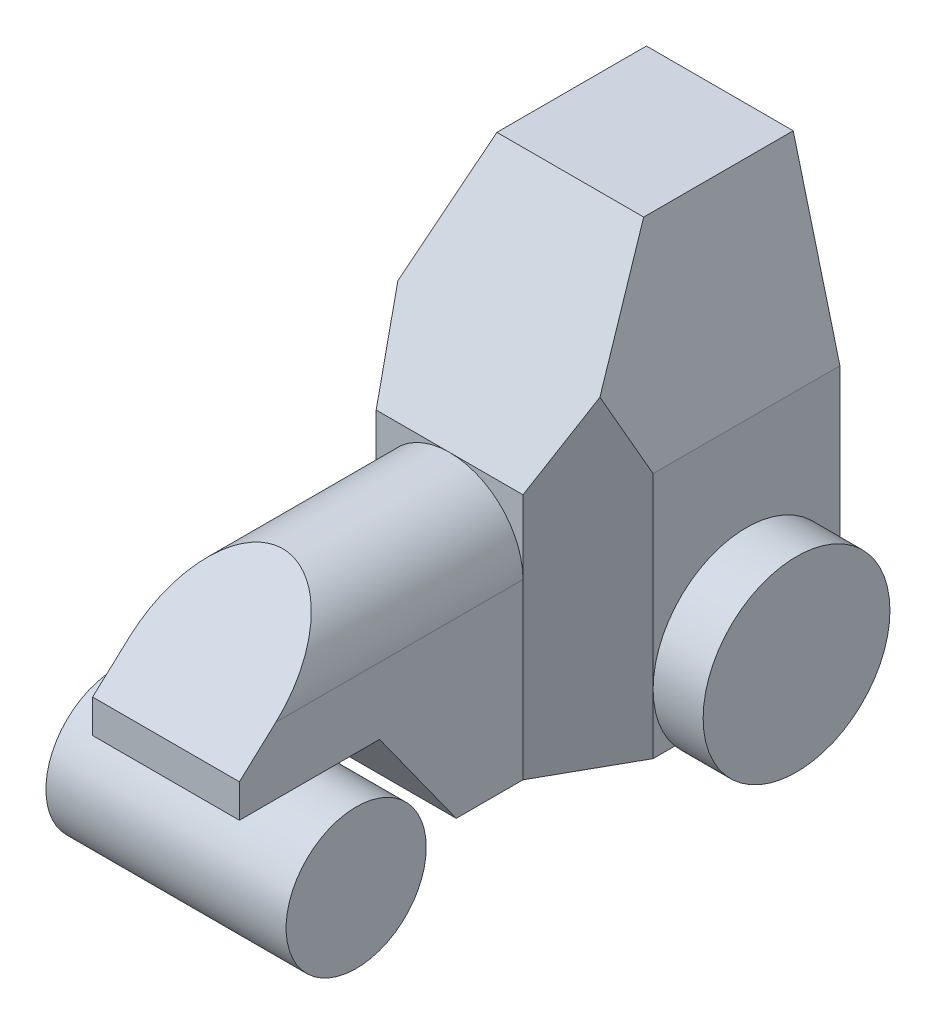
ISO-10303-21;
HEADER;
FILE_DESCRIPTION(('STEP AP214'),'2;1');
FILE_NAME('part.step','',(''),(''),'','','');
FILE_SCHEMA(('AUTOMOTIVE_DESIGN { 1 0 10303 214 1 1 1 1 }'));
ENDSEC;
DATA;
#1=APPLICATION_CONTEXT('core data for automotive mechanical design processes');
#2=APPLICATION_PROTOCOL_DEFINITION('international standard','automotive_design',2000,#1);
#3=PRODUCT_CONTEXT('',#1,'mechanical');
#4=PRODUCT('Part','Part','',(#3));
#5=PRODUCT_RELATED_PRODUCT_CATEGORY('part','',(#4));
#6=PRODUCT_DEFINITION_FORMATION('','',#4);
#7=PRODUCT_DEFINITION_CONTEXT('part definition',#1,'design');
#8=PRODUCT_DEFINITION('design','',#6,#7);
#9=PRODUCT_DEFINITION_SHAPE('','',#8);
#10=(LENGTH_UNIT() NAMED_UNIT(*) SI_UNIT(.MILLI.,.METRE.));
#11=(NAMED_UNIT(*) PLANE_ANGLE_UNIT() SI_UNIT($,.RADIAN.));
#12=(NAMED_UNIT(*) SI_UNIT($,.STERADIAN.) SOLID_ANGLE_UNIT());
#13=UNCERTAINTY_MEASURE_WITH_UNIT(LENGTH_MEASURE(1.E-05),#10,'distance_accuracy_value','');
#14=(GEOMETRIC_REPRESENTATION_CONTEXT(3) GLOBAL_UNCERTAINTY_ASSIGNED_CONTEXT((#13)) GLOBAL_UNIT_ASSIGNED_CONTEXT((#10,
#11,#12)) REPRESENTATION_CONTEXT('',''));
#15=CARTESIAN_POINT('',(0.,0.,0.));
#16=DIRECTION('',(0.,0.,1.));
#17=DIRECTION('',(1.,0.,0.));
#18=AXIS2_PLACEMENT_3D('',#15,#16,#17);
#19=CARTESIAN_POINT('',(0.,11.,64.));
#20=DIRECTION('',(1.,0.,0.));
#21=DIRECTION('',(0.,0.,-1.));
#22=AXIS2_PLACEMENT_3D('',#19,#20,#21);
#23=CYLINDRICAL_SURFACE('',#22,21.);
#24=CARTESIAN_POINT('',(0.,11.,64.));
#25=DIRECTION('',(1.,0.,0.));
#26=DIRECTION('',(0.,0.,-1.));
#27=AXIS2_PLACEMENT_3D('',#24,#25,#26);
#28=CIRCLE('',#27,21.);
#29=CARTESIAN_POINT('',(0.,11.,43.));
#30=VERTEX_POINT('',#29);
#31=EDGE_CURVE('E11',#30,#30,#28,.T.);
#32=ORIENTED_EDGE('',*,*,#31,.T.);
#33=EDGE_LOOP('',(#32));
#34=FACE_BOUND('',#33,.T.);
#35=CARTESIAN_POINT('',(72.,11.,64.));
#36=DIRECTION('',(1.,0.,0.));
#37=DIRECTION('',(0.,0.,-1.));
#38=AXIS2_PLACEMENT_3D('',#35,#36,#37);
#39=CIRCLE('',#38,21.);
#40=CARTESIAN_POINT('',(72.,11.,43.));
#41=VERTEX_POINT('',#40);
#42=EDGE_CURVE('E52',#41,#41,#39,.T.);
#43=ORIENTED_EDGE('',*,*,#42,.F.);
#44=EDGE_LOOP('',(#43));
#45=FACE_BOUND('',#44,.T.);
#46=ADVANCED_FACE('F49',(#34,#45),#23,.T.);
#47=CARTESIAN_POINT('',(0.,11.,64.));
#48=DIRECTION('',(1.,0.,0.));
#49=DIRECTION('',(0.,0.,-1.));
#50=AXIS2_PLACEMENT_3D('',#47,#48,#49);
#51=PLANE('',#50);
#52=ORIENTED_EDGE('',*,*,#31,.F.);
#53=EDGE_LOOP('',(#52));
#54=FACE_BOUND('',#53,.T.);
#55=ADVANCED_FACE('F64',(#54),#51,.F.);
#56=CARTESIAN_POINT('',(72.,11.,64.));
#57=DIRECTION('',(1.,0.,0.));
#58=DIRECTION('',(0.,0.,-1.));
#59=AXIS2_PLACEMENT_3D('',#56,#57,#58);
#60=PLANE('',#59);
#61=ORIENTED_EDGE('',*,*,#42,.T.);
#62=EDGE_LOOP('',(#61));
#63=FACE_BOUND('',#62,.T.);
#64=ADVANCED_FACE('F61',(#63),#60,.T.);
#65=CLOSED_SHELL('',(#46,#55,#64));
#66=MANIFOLD_SOLID_BREP('B2',#65);
#67=CARTESIAN_POINT('',(0.,128.,0.));
#68=DIRECTION('',(0.,0.,-1.));
#69=DIRECTION('',(-1.,0.,0.));
#70=AXIS2_PLACEMENT_3D('',#67,#68,#69);
#71=PLANE('',#70);
#72=CARTESIAN_POINT('',(36.,52.,0.));
#73=DIRECTION('',(0.,0.,1.));
#74=DIRECTION('',(1.,0.,0.));
#75=AXIS2_PLACEMENT_3D('',#72,#73,#74);
#76=CIRCLE('',#75,22.);
#77=CARTESIAN_POINT('',(58.,52.,0.));
#78=VERTEX_POINT('',#77);
#79=CARTESIAN_POINT('',(36.,74.,0.));
#80=VERTEX_POINT('',#79);
#81=EDGE_CURVE('E262',#78,#80,#76,.T.);
#82=ORIENTED_EDGE('',*,*,#81,.F.);
#83=DIRECTION('',(0.,1.,0.));
#84=VECTOR('',#83,1.);
#85=CARTESIAN_POINT('',(58.,0.,0.));
#86=LINE('',#85,#84);
#87=CARTESIAN_POINT('',(58.,74.,0.));
#88=VERTEX_POINT('',#87);
#89=EDGE_CURVE('E343',#78,#88,#86,.T.);
#90=ORIENTED_EDGE('',*,*,#89,.T.);
#91=DIRECTION('',(1.,0.,0.));
#92=VECTOR('',#91,1.);
#93=CARTESIAN_POINT('',(-56.,74.,0.));
#94=LINE('',#93,#92);
#95=EDGE_CURVE('E284',#80,#88,#94,.T.);
#96=ORIENTED_EDGE('',*,*,#95,.F.);
#97=EDGE_LOOP('',(#82,#90,#96));
#98=FACE_BOUND('',#97,.T.);
#99=ADVANCED_FACE('F90',(#98),#71,.F.);
#100=CARTESIAN_POINT('',(0.,128.,0.));
#101=DIRECTION('',(1.,0.,0.));
#102=DIRECTION('',(0.,0.,-1.));
#103=AXIS2_PLACEMENT_3D('',#100,#101,#102);
#104=PLANE('',#103);
#105=CARTESIAN_POINT('',(0.,18.,-53.));
#106=DIRECTION('',(-1.,0.,0.));
#107=DIRECTION('',(0.,0.,1.));
#108=AXIS2_PLACEMENT_3D('',#105,#106,#107);
#109=CIRCLE('',#108,28.);
#110=CARTESIAN_POINT('',(0.,18.,-81.));
#111=VERTEX_POINT('',#110);
#112=CARTESIAN_POINT('',(0.,0.,-74.4476105895272));
#113=VERTEX_POINT('',#112);
#114=EDGE_CURVE('E456',#111,#113,#109,.T.);
#115=ORIENTED_EDGE('',*,*,#114,.F.);
#116=DIRECTION('',(0.,-1.,0.));
#117=VECTOR('',#116,1.);
#118=CARTESIAN_POINT('',(0.,128.,-81.));
#119=LINE('',#118,#117);
#120=CARTESIAN_POINT('',(0.,0.,-81.));
#121=VERTEX_POINT('',#120);
#122=EDGE_CURVE('E363',#111,#121,#119,.T.);
#123=ORIENTED_EDGE('',*,*,#122,.T.);
#124=DIRECTION('',(0.,0.,1.));
#125=VECTOR('',#124,1.);
#126=CARTESIAN_POINT('',(0.,0.,0.));
#127=LINE('',#126,#125);
#128=EDGE_CURVE('E365',#121,#113,#127,.T.);
#129=ORIENTED_EDGE('',*,*,#128,.T.);
#130=EDGE_LOOP('',(#115,#123,#129));
#131=FACE_BOUND('',#130,.T.);
#132=ADVANCED_FACE('F525',(#131),#104,.F.);
#133=CARTESIAN_POINT('',(0.,18.,-25.));
#134=VERTEX_POINT('',#133);
#135=EDGE_CURVE('E275',#134,#111,#109,.T.);
#136=ORIENTED_EDGE('',*,*,#135,.F.);
#137=DIRECTION('',(0.,1.,0.));
#138=VECTOR('',#137,1.);
#139=CARTESIAN_POINT('',(0.,0.,-25.));
#140=LINE('',#139,#138);
#141=CARTESIAN_POINT('',(0.,74.,-25.));
#142=VERTEX_POINT('',#141);
#143=EDGE_CURVE('E351',#134,#142,#140,.T.);
#144=ORIENTED_EDGE('',*,*,#143,.T.);
#145=DIRECTION('',(0.,0.,1.));
#146=VECTOR('',#145,1.);
#147=CARTESIAN_POINT('',(0.,74.,-81.));
#148=LINE('',#147,#146);
#149=CARTESIAN_POINT('',(0.,74.,-81.));
#150=VERTEX_POINT('',#149);
#151=EDGE_CURVE('E328',#150,#142,#148,.T.);
#152=ORIENTED_EDGE('',*,*,#151,.F.);
#153=EDGE_CURVE('E379',#150,#111,#119,.T.);
#154=ORIENTED_EDGE('',*,*,#153,.T.);
#155=EDGE_LOOP('',(#136,#144,#152,#154));
#156=FACE_BOUND('',#155,.T.);
#157=ADVANCED_FACE('F519',(#156),#104,.F.);
#158=CARTESIAN_POINT('',(72.,128.,0.));
#159=DIRECTION('',(-1.,0.,0.));
#160=DIRECTION('',(0.,0.,1.));
#161=AXIS2_PLACEMENT_3D('',#158,#159,#160);
#162=PLANE('',#161);
#163=CARTESIAN_POINT('',(72.,18.,-53.));
#164=DIRECTION('',(1.,0.,0.));
#165=DIRECTION('',(0.,0.,-1.));
#166=AXIS2_PLACEMENT_3D('',#163,#164,#165);
#167=CIRCLE('',#166,28.);
#168=CARTESIAN_POINT('',(72.,18.,-25.));
#169=VERTEX_POINT('',#168);
#170=CARTESIAN_POINT('',(72.,0.,-31.5523894104728));
#171=VERTEX_POINT('',#170);
#172=EDGE_CURVE('E453',#169,#171,#167,.T.);
#173=ORIENTED_EDGE('',*,*,#172,.F.);
#174=DIRECTION('',(0.,1.,0.));
#175=VECTOR('',#174,1.);
#176=CARTESIAN_POINT('',(72.,0.,-25.));
#177=LINE('',#176,#175);
#178=CARTESIAN_POINT('',(72.,0.,-25.));
#179=VERTEX_POINT('',#178);
#180=EDGE_CURVE('E344',#179,#169,#177,.T.);
#181=ORIENTED_EDGE('',*,*,#180,.F.);
#182=DIRECTION('',(0.,0.,-1.));
#183=VECTOR('',#182,1.);
#184=CARTESIAN_POINT('',(72.,0.,0.));
#185=LINE('',#184,#183);
#186=EDGE_CURVE('E371',#179,#171,#185,.T.);
#187=ORIENTED_EDGE('',*,*,#186,.T.);
#188=EDGE_LOOP('',(#173,#181,#187));
#189=FACE_BOUND('',#188,.T.);
#190=ADVANCED_FACE('F517',(#189),#162,.F.);
#191=CARTESIAN_POINT('',(72.,18.,-81.));
#192=VERTEX_POINT('',#191);
#193=EDGE_CURVE('E285',#192,#169,#167,.T.);
#194=ORIENTED_EDGE('',*,*,#193,.F.);
#195=DIRECTION('',(0.,-1.,0.));
#196=VECTOR('',#195,1.);
#197=CARTESIAN_POINT('',(72.,128.,-81.));
#198=LINE('',#197,#196);
#199=CARTESIAN_POINT('',(72.,74.,-81.));
#200=VERTEX_POINT('',#199);
#201=EDGE_CURVE('E384',#200,#192,#198,.T.);
#202=ORIENTED_EDGE('',*,*,#201,.F.);
#203=DIRECTION('',(0.,0.,1.));
#204=VECTOR('',#203,1.);
#205=CARTESIAN_POINT('',(72.,74.,-81.));
#206=LINE('',#205,#204);
#207=CARTESIAN_POINT('',(72.,74.,-25.));
#208=VERTEX_POINT('',#207);
#209=EDGE_CURVE('E317',#200,#208,#206,.T.);
#210=ORIENTED_EDGE('',*,*,#209,.T.);
#211=EDGE_CURVE('E337',#169,#208,#177,.T.);
#212=ORIENTED_EDGE('',*,*,#211,.F.);
#213=EDGE_LOOP('',(#194,#202,#210,#212));
#214=FACE_BOUND('',#213,.T.);
#215=ADVANCED_FACE('F499',(#214),#162,.F.);
#216=CARTESIAN_POINT('',(0.,0.,-31.5523894104728));
#217=VERTEX_POINT('',#216);
#218=EDGE_CURVE('E279',#217,#134,#109,.T.);
#219=ORIENTED_EDGE('',*,*,#218,.F.);
#220=CARTESIAN_POINT('',(0.,0.,-25.));
#221=VERTEX_POINT('',#220);
#222=EDGE_CURVE('E342',#217,#221,#127,.T.);
#223=ORIENTED_EDGE('',*,*,#222,.T.);
#224=EDGE_CURVE('E356',#221,#134,#140,.T.);
#225=ORIENTED_EDGE('',*,*,#224,.T.);
#226=EDGE_LOOP('',(#219,#223,#225));
#227=FACE_BOUND('',#226,.T.);
#228=ADVANCED_FACE('F92',(#227),#104,.F.);
#229=CARTESIAN_POINT('',(14.,52.,0.));
#230=VERTEX_POINT('',#229);
#231=EDGE_CURVE('E401',#80,#230,#76,.T.);
#232=ORIENTED_EDGE('',*,*,#231,.F.);
#233=CARTESIAN_POINT('',(14.,74.,0.));
#234=VERTEX_POINT('',#233);
#235=EDGE_CURVE('E295',#234,#80,#94,.T.);
#236=ORIENTED_EDGE('',*,*,#235,.F.);
#237=DIRECTION('',(0.,1.,0.));
#238=VECTOR('',#237,1.);
#239=CARTESIAN_POINT('',(14.,0.,0.));
#240=LINE('',#239,#238);
#241=EDGE_CURVE('E355',#230,#234,#240,.T.);
#242=ORIENTED_EDGE('',*,*,#241,.F.);
#243=EDGE_LOOP('',(#232,#236,#242));
#244=FACE_BOUND('',#243,.T.);
#245=ADVANCED_FACE('F446',(#244),#71,.F.);
#246=CARTESIAN_POINT('',(72.,0.,-74.4476105895272));
#247=VERTEX_POINT('',#246);
#248=EDGE_CURVE('E289',#247,#192,#167,.T.);
#249=ORIENTED_EDGE('',*,*,#248,.F.);
#250=CARTESIAN_POINT('',(72.,0.,-81.));
#251=VERTEX_POINT('',#250);
#252=EDGE_CURVE('E369',#247,#251,#185,.T.);
#253=ORIENTED_EDGE('',*,*,#252,.T.);
#254=EDGE_CURVE('E383',#192,#251,#198,.T.);
#255=ORIENTED_EDGE('',*,*,#254,.F.);
#256=EDGE_LOOP('',(#249,#253,#255));
#257=FACE_BOUND('',#256,.T.);
#258=ADVANCED_FACE('F475',(#257),#162,.F.);
#259=CARTESIAN_POINT('',(0.,128.,-81.));
#260=DIRECTION('',(0.,0.,1.));
#261=DIRECTION('',(1.,0.,0.));
#262=AXIS2_PLACEMENT_3D('',#259,#260,#261);
#263=PLANE('',#262);
#264=DIRECTION('',(-1.,0.,0.));
#265=VECTOR('',#264,1.);
#266=CARTESIAN_POINT('',(0.,128.,-81.));
#267=LINE('',#266,#265);
#268=CARTESIAN_POINT('',(58.,128.,-81.));
#269=VERTEX_POINT('',#268);
#270=CARTESIAN_POINT('',(14.,128.,-81.));
#271=VERTEX_POINT('',#270);
#272=EDGE_CURVE('E359',#269,#271,#267,.T.);
#273=ORIENTED_EDGE('',*,*,#272,.F.);
#274=DIRECTION('',(0.250962158783726,-0.967996898165801,0.));
#275=VECTOR('',#274,1.);
#276=CARTESIAN_POINT('',(58.,128.,-81.));
#277=LINE('',#276,#275);
#278=EDGE_CURVE('E311',#269,#200,#277,.T.);
#279=ORIENTED_EDGE('',*,*,#278,.T.);
#280=ORIENTED_EDGE('',*,*,#201,.T.);
#281=ORIENTED_EDGE('',*,*,#254,.T.);
#282=DIRECTION('',(-1.,0.,0.));
#283=VECTOR('',#282,1.);
#284=CARTESIAN_POINT('',(0.,0.,-81.));
#285=LINE('',#284,#283);
#286=EDGE_CURVE('E364',#251,#121,#285,.T.);
#287=ORIENTED_EDGE('',*,*,#286,.T.);
#288=ORIENTED_EDGE('',*,*,#122,.F.);
#289=ORIENTED_EDGE('',*,*,#153,.F.);
#290=DIRECTION('',(0.250962158783726,0.967996898165801,0.));
#291=VECTOR('',#290,1.);
#292=CARTESIAN_POINT('',(14.,128.,-81.));
#293=LINE('',#292,#291);
#294=EDGE_CURVE('E310',#150,#271,#293,.T.);
#295=ORIENTED_EDGE('',*,*,#294,.T.);
#296=EDGE_LOOP('',(#273,#279,#280,#281,#287,#288,#289,#295));
#297=FACE_BOUND('',#296,.T.);
#298=ADVANCED_FACE('F502',(#297),#263,.F.);
#299=CARTESIAN_POINT('',(0.,128.,0.));
#300=DIRECTION('',(0.,-1.,0.));
#301=DIRECTION('',(0.,0.,-1.));
#302=AXIS2_PLACEMENT_3D('',#299,#300,#301);
#303=PLANE('',#302);
#304=DIRECTION('',(0.,0.,1.));
#305=VECTOR('',#304,1.);
#306=CARTESIAN_POINT('',(14.,128.,-81.));
#307=LINE('',#306,#305);
#308=CARTESIAN_POINT('',(14.,128.,-36.1801050302511));
#309=VERTEX_POINT('',#308);
#310=EDGE_CURVE('E316',#271,#309,#307,.T.);
#311=ORIENTED_EDGE('',*,*,#310,.T.);
#312=DIRECTION('',(1.,0.,0.));
#313=VECTOR('',#312,1.);
#314=CARTESIAN_POINT('',(-56.,128.,-36.1801050302511));
#315=LINE('',#314,#313);
#316=CARTESIAN_POINT('',(58.,128.,-36.1801050302511));
#317=VERTEX_POINT('',#316);
#318=EDGE_CURVE('E290',#309,#317,#315,.T.);
#319=ORIENTED_EDGE('',*,*,#318,.T.);
#320=DIRECTION('',(0.,0.,1.));
#321=VECTOR('',#320,1.);
#322=CARTESIAN_POINT('',(58.,128.,-81.));
#323=LINE('',#322,#321);
#324=EDGE_CURVE('E315',#269,#317,#323,.T.);
#325=ORIENTED_EDGE('',*,*,#324,.F.);
#326=ORIENTED_EDGE('',*,*,#272,.T.);
#327=EDGE_LOOP('',(#311,#319,#325,#326));
#328=FACE_BOUND('',#327,.T.);
#329=ADVANCED_FACE('F505',(#328),#303,.F.);
#330=CARTESIAN_POINT('',(0.,0.,0.));
#331=DIRECTION('',(0.,-1.,0.));
#332=DIRECTION('',(0.,0.,-1.));
#333=AXIS2_PLACEMENT_3D('',#330,#331,#332);
#334=PLANE('',#333);
#335=DIRECTION('',(1.,0.,0.));
#336=VECTOR('',#335,1.);
#337=CARTESIAN_POINT('',(-27.,0.,20.));
#338=LINE('',#337,#336);
#339=CARTESIAN_POINT('',(14.,0.,20.));
#340=VERTEX_POINT('',#339);
#341=CARTESIAN_POINT('',(58.,0.,20.));
#342=VERTEX_POINT('',#341);
#343=EDGE_CURVE('E226',#340,#342,#338,.T.);
#344=ORIENTED_EDGE('',*,*,#343,.F.);
#345=DIRECTION('',(0.,0.,-1.));
#346=VECTOR('',#345,1.);
#347=CARTESIAN_POINT('',(14.,0.,85.));
#348=LINE('',#347,#346);
#349=CARTESIAN_POINT('',(14.,0.,0.));
#350=VERTEX_POINT('',#349);
#351=EDGE_CURVE('E251',#340,#350,#348,.T.);
#352=ORIENTED_EDGE('',*,*,#351,.T.);
#353=DIRECTION('',(-0.488603368931843,0.,-0.87250601594972));
#354=VECTOR('',#353,1.);
#355=CARTESIAN_POINT('',(0.,0.,-25.));
#356=LINE('',#355,#354);
#357=EDGE_CURVE('E321',#350,#221,#356,.T.);
#358=ORIENTED_EDGE('',*,*,#357,.T.);
#359=ORIENTED_EDGE('',*,*,#222,.F.);
#360=EDGE_CURVE('E370',#113,#217,#127,.T.);
#361=ORIENTED_EDGE('',*,*,#360,.F.);
#362=ORIENTED_EDGE('',*,*,#128,.F.);
#363=ORIENTED_EDGE('',*,*,#286,.F.);
#364=ORIENTED_EDGE('',*,*,#252,.F.);
#365=EDGE_CURVE('E375',#171,#247,#185,.T.);
#366=ORIENTED_EDGE('',*,*,#365,.F.);
#367=ORIENTED_EDGE('',*,*,#186,.F.);
#368=DIRECTION('',(-0.488603368931843,0.,0.87250601594972));
#369=VECTOR('',#368,1.);
#370=CARTESIAN_POINT('',(72.,0.,-25.));
#371=LINE('',#370,#369);
#372=CARTESIAN_POINT('',(58.,0.,0.));
#373=VERTEX_POINT('',#372);
#374=EDGE_CURVE('E249',#179,#373,#371,.T.);
#375=ORIENTED_EDGE('',*,*,#374,.T.);
#376=DIRECTION('',(0.,0.,-1.));
#377=VECTOR('',#376,1.);
#378=CARTESIAN_POINT('',(58.,0.,85.));
#379=LINE('',#378,#377);
#380=EDGE_CURVE('E241',#342,#373,#379,.T.);
#381=ORIENTED_EDGE('',*,*,#380,.F.);
#382=EDGE_LOOP('',(#344,#352,#358,#359,#361,#362,#363,#364,#366,#367,#375,#381));
#383=FACE_BOUND('',#382,.T.);
#384=ADVANCED_FACE('F247',(#383),#334,.T.);
#385=CARTESIAN_POINT('',(0.,0.,-25.));
#386=DIRECTION('',(0.87250601594972,0.,-0.488603368931843));
#387=DIRECTION('',(-0.488603368931843,0.,-0.87250601594972));
#388=AXIS2_PLACEMENT_3D('',#385,#386,#387);
#389=PLANE('',#388);
#390=EDGE_CURVE('E338',#350,#230,#240,.T.);
#391=ORIENTED_EDGE('',*,*,#390,.T.);
#392=ORIENTED_EDGE('',*,*,#241,.T.);
#393=DIRECTION('',(-0.297583909598807,0.793131784961625,-0.531399838569298));
#394=VECTOR('',#393,1.);
#395=CARTESIAN_POINT('',(26.2725334437309,41.2907840704486,21.9152382923765));
#396=LINE('',#395,#394);
#397=CARTESIAN_POINT('',(5.72081397746765,96.0659967702324,-14.784260754522));
#398=VERTEX_POINT('',#397);
#399=EDGE_CURVE('E294',#234,#398,#396,.T.);
#400=ORIENTED_EDGE('',*,*,#399,.T.);
#401=DIRECTION('',(-0.229016348962367,-0.883348774569128,-0.408957766004226));
#402=VECTOR('',#401,1.);
#403=CARTESIAN_POINT('',(-14.970297029703,16.2574257425743,-51.7326732673267));
#404=LINE('',#403,#402);
#405=EDGE_CURVE('E391',#398,#142,#404,.T.);
#406=ORIENTED_EDGE('',*,*,#405,.T.);
#407=ORIENTED_EDGE('',*,*,#143,.F.);
#408=ORIENTED_EDGE('',*,*,#224,.F.);
#409=ORIENTED_EDGE('',*,*,#357,.F.);
#410=EDGE_LOOP('',(#391,#392,#400,#406,#407,#408,#409));
#411=FACE_BOUND('',#410,.T.);
#412=ADVANCED_FACE('F441',(#411),#389,.F.);
#413=CARTESIAN_POINT('',(72.,0.,-25.));
#414=DIRECTION('',(-0.87250601594972,0.,-0.488603368931843));
#415=DIRECTION('',(-0.488603368931843,0.,0.87250601594972));
#416=AXIS2_PLACEMENT_3D('',#413,#414,#415);
#417=PLANE('',#416);
#418=DIRECTION('',(-0.229016348962367,0.883348774569128,0.408957766004226));
#419=VECTOR('',#418,1.);
#420=CARTESIAN_POINT('',(86.970297029703,16.2574257425743,-51.7326732673267));
#421=LINE('',#420,#419);
#422=CARTESIAN_POINT('',(66.2791860225324,96.0659967702324,-14.784260754522));
#423=VERTEX_POINT('',#422);
#424=EDGE_CURVE('E387',#208,#423,#421,.T.);
#425=ORIENTED_EDGE('',*,*,#424,.T.);
#426=DIRECTION('',(-0.297583909598807,-0.793131784961625,0.531399838569298));
#427=VECTOR('',#426,1.);
#428=CARTESIAN_POINT('',(45.7274665562691,41.2907840704486,21.9152382923765));
#429=LINE('',#428,#427);
#430=EDGE_CURVE('E306',#423,#88,#429,.T.);
#431=ORIENTED_EDGE('',*,*,#430,.T.);
#432=ORIENTED_EDGE('',*,*,#89,.F.);
#433=EDGE_CURVE('E339',#373,#78,#86,.T.);
#434=ORIENTED_EDGE('',*,*,#433,.F.);
#435=ORIENTED_EDGE('',*,*,#374,.F.);
#436=ORIENTED_EDGE('',*,*,#180,.T.);
#437=ORIENTED_EDGE('',*,*,#211,.T.);
#438=EDGE_LOOP('',(#425,#431,#432,#434,#435,#436,#437));
#439=FACE_BOUND('',#438,.T.);
#440=ADVANCED_FACE('F493',(#439),#417,.F.);
#441=CARTESIAN_POINT('',(58.,128.,-81.));
#442=DIRECTION('',(-0.967996898165801,-0.250962158783726,0.));
#443=DIRECTION('',(0.250962158783726,-0.967996898165801,0.));
#444=AXIS2_PLACEMENT_3D('',#441,#442,#443);
#445=PLANE('',#444);
#446=ORIENTED_EDGE('',*,*,#324,.T.);
#447=DIRECTION('',(0.210556075945089,-0.812144864359631,0.54413863874649));
#448=VECTOR('',#447,1.);
#449=CARTESIAN_POINT('',(52.8649085943667,147.806781136014,-49.4506869156619));
#450=LINE('',#449,#448);
#451=EDGE_CURVE('E302',#317,#423,#450,.T.);
#452=ORIENTED_EDGE('',*,*,#451,.T.);
#453=ORIENTED_EDGE('',*,*,#424,.F.);
#454=ORIENTED_EDGE('',*,*,#209,.F.);
#455=ORIENTED_EDGE('',*,*,#278,.F.);
#456=EDGE_LOOP('',(#446,#452,#453,#454,#455));
#457=FACE_BOUND('',#456,.T.);
#458=ADVANCED_FACE('F497',(#457),#445,.F.);
#459=CARTESIAN_POINT('',(14.,128.,-81.));
#460=DIRECTION('',(0.967996898165801,-0.250962158783726,0.));
#461=DIRECTION('',(0.250962158783726,0.967996898165801,0.));
#462=AXIS2_PLACEMENT_3D('',#459,#460,#461);
#463=PLANE('',#462);
#464=ORIENTED_EDGE('',*,*,#405,.F.);
#465=DIRECTION('',(0.210556075945089,0.812144864359631,-0.54413863874649));
#466=VECTOR('',#465,1.);
#467=CARTESIAN_POINT('',(19.1350914056333,147.806781136014,-49.4506869156619));
#468=LINE('',#467,#466);
#469=EDGE_CURVE('E395',#398,#309,#468,.T.);
#470=ORIENTED_EDGE('',*,*,#469,.T.);
#471=ORIENTED_EDGE('',*,*,#310,.F.);
#472=ORIENTED_EDGE('',*,*,#294,.F.);
#473=ORIENTED_EDGE('',*,*,#151,.T.);
#474=EDGE_LOOP('',(#464,#470,#471,#472,#473));
#475=FACE_BOUND('',#474,.T.);
#476=ADVANCED_FACE('F510',(#475),#463,.F.);
#477=CARTESIAN_POINT('',(-56.,74.,0.));
#478=DIRECTION('',(0.,-0.556617000465402,-0.830769230769231));
#479=DIRECTION('',(0.,0.830769230769231,-0.556617000465402));
#480=AXIS2_PLACEMENT_3D('',#477,#478,#479);
#481=PLANE('',#480);
#482=ORIENTED_EDGE('',*,*,#451,.F.);
#483=ORIENTED_EDGE('',*,*,#318,.F.);
#484=ORIENTED_EDGE('',*,*,#469,.F.);
#485=ORIENTED_EDGE('',*,*,#399,.F.);
#486=ORIENTED_EDGE('',*,*,#235,.T.);
#487=ORIENTED_EDGE('',*,*,#95,.T.);
#488=ORIENTED_EDGE('',*,*,#430,.F.);
#489=EDGE_LOOP('',(#482,#483,#484,#485,#486,#487,#488));
#490=FACE_BOUND('',#489,.T.);
#491=ADVANCED_FACE('F507',(#490),#481,.F.);
#492=CARTESIAN_POINT('',(72.,18.,-53.));
#493=DIRECTION('',(1.,0.,0.));
#494=DIRECTION('',(0.,0.,-1.));
#495=AXIS2_PLACEMENT_3D('',#492,#493,#494);
#496=PLANE('',#495);
#497=EDGE_CURVE('E274',#171,#247,#167,.T.);
#498=ORIENTED_EDGE('',*,*,#497,.F.);
#499=ORIENTED_EDGE('',*,*,#365,.T.);
#500=EDGE_LOOP('',(#498,#499));
#501=FACE_BOUND('',#500,.T.);
#502=ADVANCED_FACE('F482',(#501),#496,.F.);
#503=CARTESIAN_POINT('',(87.,18.,-53.));
#504=DIRECTION('',(-1.,0.,0.));
#505=DIRECTION('',(0.,0.,1.));
#506=AXIS2_PLACEMENT_3D('',#503,#504,#505);
#507=CYLINDRICAL_SURFACE('',#506,28.);
#508=CARTESIAN_POINT('',(87.,18.,-53.));
#509=DIRECTION('',(1.,0.,0.));
#510=DIRECTION('',(0.,0.,-1.));
#511=AXIS2_PLACEMENT_3D('',#508,#509,#510);
#512=CIRCLE('',#511,28.);
#513=CARTESIAN_POINT('',(87.,18.,-81.));
#514=VERTEX_POINT('',#513);
#515=EDGE_CURVE('E280',#514,#514,#512,.T.);
#516=ORIENTED_EDGE('',*,*,#515,.F.);
#517=EDGE_LOOP('',(#516));
#518=FACE_BOUND('',#517,.T.);
#519=ORIENTED_EDGE('',*,*,#193,.T.);
#520=ORIENTED_EDGE('',*,*,#172,.T.);
#521=ORIENTED_EDGE('',*,*,#497,.T.);
#522=ORIENTED_EDGE('',*,*,#248,.T.);
#523=EDGE_LOOP('',(#519,#520,#521,#522));
#524=FACE_BOUND('',#523,.T.);
#525=ADVANCED_FACE('F469',(#518,#524),#507,.T.);
#526=CARTESIAN_POINT('',(87.,18.,-53.));
#527=DIRECTION('',(1.,0.,0.));
#528=DIRECTION('',(0.,0.,-1.));
#529=AXIS2_PLACEMENT_3D('',#526,#527,#528);
#530=PLANE('',#529);
#531=ORIENTED_EDGE('',*,*,#515,.T.);
#532=EDGE_LOOP('',(#531));
#533=FACE_BOUND('',#532,.T.);
#534=ADVANCED_FACE('F546',(#533),#530,.T.);
#535=CARTESIAN_POINT('',(0.,18.,-53.));
#536=DIRECTION('',(-1.,0.,0.));
#537=DIRECTION('',(0.,0.,1.));
#538=AXIS2_PLACEMENT_3D('',#535,#536,#537);
#539=PLANE('',#538);
#540=EDGE_CURVE('E269',#113,#217,#109,.T.);
#541=ORIENTED_EDGE('',*,*,#540,.F.);
#542=ORIENTED_EDGE('',*,*,#360,.T.);
#543=EDGE_LOOP('',(#541,#542));
#544=FACE_BOUND('',#543,.T.);
#545=ADVANCED_FACE('F543',(#544),#539,.F.);
#546=CARTESIAN_POINT('',(-15.,18.,-53.));
#547=DIRECTION('',(1.,0.,0.));
#548=DIRECTION('',(0.,0.,-1.));
#549=AXIS2_PLACEMENT_3D('',#546,#547,#548);
#550=CYLINDRICAL_SURFACE('',#549,28.);
#551=CARTESIAN_POINT('',(-15.,18.,-53.));
#552=DIRECTION('',(-1.,0.,0.));
#553=DIRECTION('',(0.,0.,1.));
#554=AXIS2_PLACEMENT_3D('',#551,#552,#553);
#555=CIRCLE('',#554,28.);
#556=CARTESIAN_POINT('',(-15.,18.,-25.));
#557=VERTEX_POINT('',#556);
#558=EDGE_CURVE('E270',#557,#557,#555,.T.);
#559=ORIENTED_EDGE('',*,*,#558,.F.);
#560=EDGE_LOOP('',(#559));
#561=FACE_BOUND('',#560,.T.);
#562=ORIENTED_EDGE('',*,*,#135,.T.);
#563=ORIENTED_EDGE('',*,*,#114,.T.);
#564=ORIENTED_EDGE('',*,*,#540,.T.);
#565=ORIENTED_EDGE('',*,*,#218,.T.);
#566=EDGE_LOOP('',(#562,#563,#564,#565));
#567=FACE_BOUND('',#566,.T.);
#568=ADVANCED_FACE('F545',(#561,#567),#550,.T.);
#569=CARTESIAN_POINT('',(-15.,18.,-53.));
#570=DIRECTION('',(-1.,0.,0.));
#571=DIRECTION('',(0.,0.,1.));
#572=AXIS2_PLACEMENT_3D('',#569,#570,#571);
#573=PLANE('',#572);
#574=ORIENTED_EDGE('',*,*,#558,.T.);
#575=EDGE_LOOP('',(#574));
#576=FACE_BOUND('',#575,.T.);
#577=ADVANCED_FACE('F552',(#576),#573,.T.);
#578=CARTESIAN_POINT('',(58.,0.,85.));
#579=DIRECTION('',(-1.,0.,0.));
#580=DIRECTION('',(0.,-1.,0.));
#581=AXIS2_PLACEMENT_3D('',#578,#579,#580);
#582=PLANE('',#581);
#583=DIRECTION('',(0.,1.,0.));
#584=VECTOR('',#583,1.);
#585=CARTESIAN_POINT('',(58.,0.,85.));
#586=LINE('',#585,#584);
#587=CARTESIAN_POINT('',(58.,32.,85.));
#588=VERTEX_POINT('',#587);
#589=CARTESIAN_POINT('',(58.,42.,85.));
#590=VERTEX_POINT('',#589);
#591=EDGE_CURVE('E259',#588,#590,#586,.T.);
#592=ORIENTED_EDGE('',*,*,#591,.F.);
#593=DIRECTION('',(0.,0.,1.));
#594=VECTOR('',#593,1.);
#595=CARTESIAN_POINT('',(58.,32.,85.));
#596=LINE('',#595,#594);
#597=CARTESIAN_POINT('',(58.,32.,43.));
#598=VERTEX_POINT('',#597);
#599=EDGE_CURVE('E114',#598,#588,#596,.T.);
#600=ORIENTED_EDGE('',*,*,#599,.F.);
#601=DIRECTION('',(0.,0.812015371342714,0.583636048152575));
#602=VECTOR('',#601,1.);
#603=CARTESIAN_POINT('',(58.,32.,43.));
#604=LINE('',#603,#602);
#605=EDGE_CURVE('E230',#342,#598,#604,.T.);
#606=ORIENTED_EDGE('',*,*,#605,.F.);
#607=ORIENTED_EDGE('',*,*,#380,.T.);
#608=ORIENTED_EDGE('',*,*,#433,.T.);
#609=DIRECTION('',(0.,0.,-1.));
#610=VECTOR('',#609,1.);
#611=CARTESIAN_POINT('',(58.,52.,85.));
#612=LINE('',#611,#610);
#613=CARTESIAN_POINT('',(58.,52.,74.0625));
#614=VERTEX_POINT('',#613);
#615=EDGE_CURVE('E266',#614,#78,#612,.T.);
#616=ORIENTED_EDGE('',*,*,#615,.F.);
#617=DIRECTION('',(0.,0.674769199544936,-0.738028812002273));
#618=VECTOR('',#617,1.);
#619=CARTESIAN_POINT('',(58.,42.,85.));
#620=LINE('',#619,#618);
#621=EDGE_CURVE('E244',#590,#614,#620,.T.);
#622=ORIENTED_EDGE('',*,*,#621,.F.);
#623=EDGE_LOOP('',(#592,#600,#606,#607,#608,#616,#622));
#624=FACE_BOUND('',#623,.T.);
#625=ADVANCED_FACE('F239',(#624),#582,.F.);
#626=CARTESIAN_POINT('',(36.,52.,85.));
#627=DIRECTION('',(0.,0.,-1.));
#628=DIRECTION('',(-1.,0.,0.));
#629=AXIS2_PLACEMENT_3D('',#626,#627,#628);
#630=CYLINDRICAL_SURFACE('',#629,22.);
#631=CARTESIAN_POINT('',(36.,52.,74.0625));
#632=DIRECTION('',(0.,-0.738028812002273,-0.674769199544936));
#633=DIRECTION('',(0.,0.674769199544936,-0.738028812002273));
#634=AXIS2_PLACEMENT_3D('',#631,#632,#633);
#635=ELLIPSE('',#634,32.6037406787933,22.);
#636=CARTESIAN_POINT('',(14.,52.,74.0625));
#637=VERTEX_POINT('',#636);
#638=EDGE_CURVE('E413',#637,#614,#635,.T.);
#639=ORIENTED_EDGE('',*,*,#638,.T.);
#640=ORIENTED_EDGE('',*,*,#615,.T.);
#641=ORIENTED_EDGE('',*,*,#81,.T.);
#642=ORIENTED_EDGE('',*,*,#231,.T.);
#643=DIRECTION('',(0.,0.,-1.));
#644=VECTOR('',#643,1.);
#645=CARTESIAN_POINT('',(14.,52.,85.));
#646=LINE('',#645,#644);
#647=EDGE_CURVE('E256',#637,#230,#646,.T.);
#648=ORIENTED_EDGE('',*,*,#647,.F.);
#649=EDGE_LOOP('',(#639,#640,#641,#642,#648));
#650=FACE_BOUND('',#649,.T.);
#651=ADVANCED_FACE('F434',(#650),#630,.T.);
#652=CARTESIAN_POINT('',(14.,52.,85.));
#653=DIRECTION('',(1.,0.,0.));
#654=DIRECTION('',(0.,1.,0.));
#655=AXIS2_PLACEMENT_3D('',#652,#653,#654);
#656=PLANE('',#655);
#657=DIRECTION('',(0.,0.812015371342714,0.583636048152575));
#658=VECTOR('',#657,1.);
#659=CARTESIAN_POINT('',(14.,65.0920798454604,66.7849323889247));
#660=LINE('',#659,#658);
#661=CARTESIAN_POINT('',(14.,32.,43.));
#662=VERTEX_POINT('',#661);
#663=EDGE_CURVE('E47',#340,#662,#660,.T.);
#664=ORIENTED_EDGE('',*,*,#663,.T.);
#665=DIRECTION('',(0.,0.,1.));
#666=VECTOR('',#665,1.);
#667=CARTESIAN_POINT('',(14.,32.,85.));
#668=LINE('',#667,#666);
#669=CARTESIAN_POINT('',(14.,32.,85.));
#670=VERTEX_POINT('',#669);
#671=EDGE_CURVE('E404',#662,#670,#668,.T.);
#672=ORIENTED_EDGE('',*,*,#671,.T.);
#673=DIRECTION('',(0.,-1.,0.));
#674=VECTOR('',#673,1.);
#675=CARTESIAN_POINT('',(14.,52.,85.));
#676=LINE('',#675,#674);
#677=CARTESIAN_POINT('',(14.,42.,85.));
#678=VERTEX_POINT('',#677);
#679=EDGE_CURVE('E252',#678,#670,#676,.T.);
#680=ORIENTED_EDGE('',*,*,#679,.F.);
#681=DIRECTION('',(0.,0.674769199544936,-0.738028812002273));
#682=VECTOR('',#681,1.);
#683=CARTESIAN_POINT('',(14.,46.5531347265452,80.0200088928413));
#684=LINE('',#683,#682);
#685=EDGE_CURVE('E106',#678,#637,#684,.T.);
#686=ORIENTED_EDGE('',*,*,#685,.T.);
#687=ORIENTED_EDGE('',*,*,#647,.T.);
#688=ORIENTED_EDGE('',*,*,#390,.F.);
#689=ORIENTED_EDGE('',*,*,#351,.F.);
#690=EDGE_LOOP('',(#664,#672,#680,#686,#687,#688,#689));
#691=FACE_BOUND('',#690,.T.);
#692=ADVANCED_FACE('F410',(#691),#656,.F.);
#693=CARTESIAN_POINT('',(36.,52.,85.));
#694=DIRECTION('',(0.,0.,1.));
#695=DIRECTION('',(1.,0.,0.));
#696=AXIS2_PLACEMENT_3D('',#693,#694,#695);
#697=PLANE('',#696);
#698=DIRECTION('',(-1.,0.,0.));
#699=VECTOR('',#698,1.);
#700=CARTESIAN_POINT('',(36.,32.,85.));
#701=LINE('',#700,#699);
#702=EDGE_CURVE('E99',#588,#670,#701,.T.);
#703=ORIENTED_EDGE('',*,*,#702,.F.);
#704=ORIENTED_EDGE('',*,*,#591,.T.);
#705=DIRECTION('',(1.,0.,0.));
#706=VECTOR('',#705,1.);
#707=CARTESIAN_POINT('',(36.,42.,85.));
#708=LINE('',#707,#706);
#709=EDGE_CURVE('E399',#678,#590,#708,.T.);
#710=ORIENTED_EDGE('',*,*,#709,.F.);
#711=ORIENTED_EDGE('',*,*,#679,.T.);
#712=EDGE_LOOP('',(#703,#704,#710,#711));
#713=FACE_BOUND('',#712,.T.);
#714=ADVANCED_FACE('F408',(#713),#697,.T.);
#715=CARTESIAN_POINT('',(-27.,42.,85.));
#716=DIRECTION('',(0.,-0.738028812002273,-0.674769199544936));
#717=DIRECTION('',(0.,0.674769199544936,-0.738028812002273));
#718=AXIS2_PLACEMENT_3D('',#715,#716,#717);
#719=PLANE('',#718);
#720=ORIENTED_EDGE('',*,*,#638,.F.);
#721=ORIENTED_EDGE('',*,*,#685,.F.);
#722=ORIENTED_EDGE('',*,*,#709,.T.);
#723=ORIENTED_EDGE('',*,*,#621,.T.);
#724=EDGE_LOOP('',(#720,#721,#722,#723));
#725=FACE_BOUND('',#724,.T.);
#726=ADVANCED_FACE('F432',(#725),#719,.F.);
#727=CARTESIAN_POINT('',(-27.,32.,43.));
#728=DIRECTION('',(0.,0.583636048152575,-0.812015371342713));
#729=DIRECTION('',(0.,0.812015371342714,0.583636048152575));
#730=AXIS2_PLACEMENT_3D('',#727,#728,#729);
#731=PLANE('',#730);
#732=ORIENTED_EDGE('',*,*,#343,.T.);
#733=ORIENTED_EDGE('',*,*,#605,.T.);
#734=DIRECTION('',(1.,0.,0.));
#735=VECTOR('',#734,1.);
#736=CARTESIAN_POINT('',(-27.,32.,43.));
#737=LINE('',#736,#735);
#738=EDGE_CURVE('E235',#662,#598,#737,.T.);
#739=ORIENTED_EDGE('',*,*,#738,.F.);
#740=ORIENTED_EDGE('',*,*,#663,.F.);
#741=EDGE_LOOP('',(#732,#733,#739,#740));
#742=FACE_BOUND('',#741,.T.);
#743=ADVANCED_FACE('F228',(#742),#731,.F.);
#744=CARTESIAN_POINT('',(-27.,32.,85.));
#745=DIRECTION('',(0.,1.,0.));
#746=DIRECTION('',(-1.,0.,0.));
#747=AXIS2_PLACEMENT_3D('',#744,#745,#746);
#748=PLANE('',#747);
#749=ORIENTED_EDGE('',*,*,#702,.T.);
#750=ORIENTED_EDGE('',*,*,#671,.F.);
#751=ORIENTED_EDGE('',*,*,#738,.T.);
#752=ORIENTED_EDGE('',*,*,#599,.T.);
#753=EDGE_LOOP('',(#749,#750,#751,#752));
#754=FACE_BOUND('',#753,.T.);
#755=ADVANCED_FACE('F403',(#754),#748,.F.);
#756=CLOSED_SHELL('',(#99,#132,#157,#190,#215,#228,#245,#258,#298,#329,#384,#412,#440,#458,#476,
#491,#502,#525,#534,#545,#568,#577,#625,#651,#692,#714,#726,#743,#755));
#757=MANIFOLD_SOLID_BREP('B6',#756);
#758=ADVANCED_BREP_SHAPE_REPRESENTATION('',(#18,#66,#757),#14);
#759=SHAPE_DEFINITION_REPRESENTATION(#9,#758);
ENDSEC;
END-ISO-10303-21;
